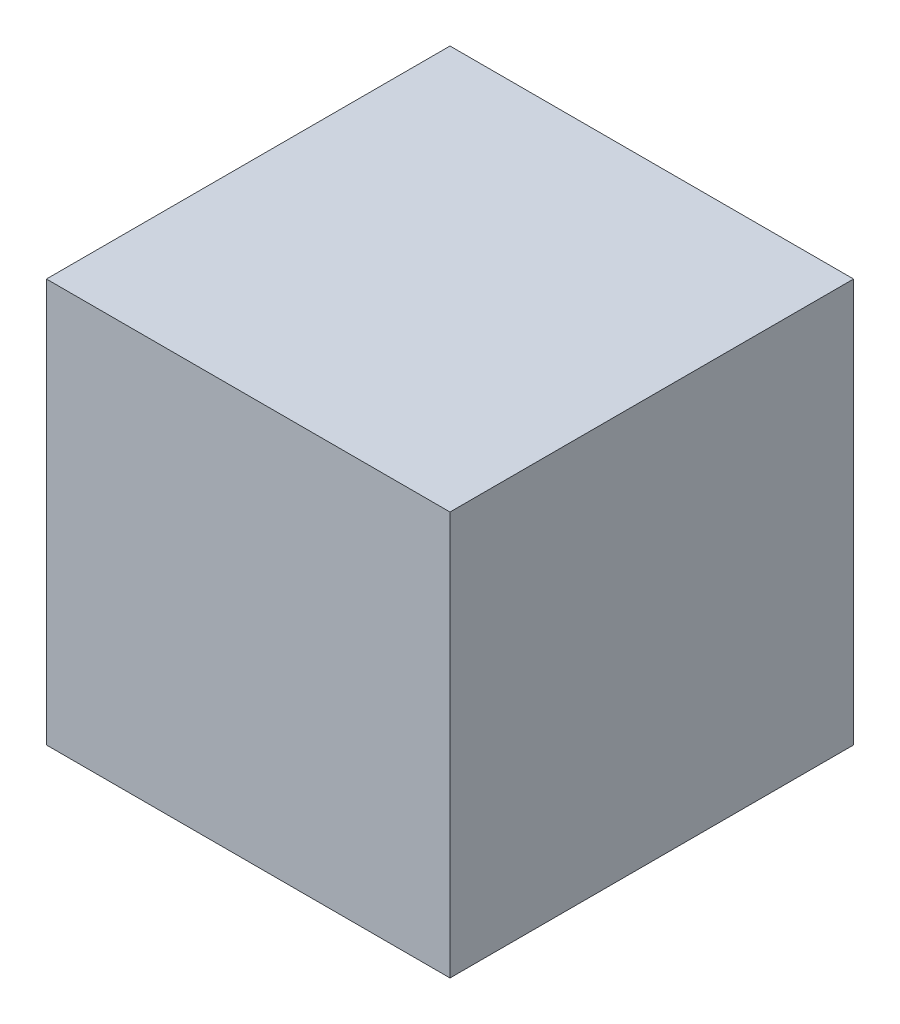
ISO-10303-21;
HEADER;
FILE_DESCRIPTION(('STEP AP214'),'2;1');
FILE_NAME('part.step','',(''),(''),'','','');
FILE_SCHEMA(('AUTOMOTIVE_DESIGN { 1 0 10303 214 1 1 1 1 }'));
ENDSEC;
DATA;
#1=APPLICATION_CONTEXT('core data for automotive mechanical design processes');
#2=APPLICATION_PROTOCOL_DEFINITION('international standard','automotive_design',2000,#1);
#3=PRODUCT_CONTEXT('',#1,'mechanical');
#4=PRODUCT('Part','Part','',(#3));
#5=PRODUCT_RELATED_PRODUCT_CATEGORY('part','',(#4));
#6=PRODUCT_DEFINITION_FORMATION('','',#4);
#7=PRODUCT_DEFINITION_CONTEXT('part definition',#1,'design');
#8=PRODUCT_DEFINITION('design','',#6,#7);
#9=PRODUCT_DEFINITION_SHAPE('','',#8);
#10=(LENGTH_UNIT() NAMED_UNIT(*) SI_UNIT(.MILLI.,.METRE.));
#11=(NAMED_UNIT(*) PLANE_ANGLE_UNIT() SI_UNIT($,.RADIAN.));
#12=(NAMED_UNIT(*) SI_UNIT($,.STERADIAN.) SOLID_ANGLE_UNIT());
#13=UNCERTAINTY_MEASURE_WITH_UNIT(LENGTH_MEASURE(1.E-05),#10,'distance_accuracy_value','');
#14=(GEOMETRIC_REPRESENTATION_CONTEXT(3) GLOBAL_UNCERTAINTY_ASSIGNED_CONTEXT((#13)) GLOBAL_UNIT_ASSIGNED_CONTEXT((#10,
#11,#12)) REPRESENTATION_CONTEXT('',''));
#15=CARTESIAN_POINT('',(0.,0.,0.));
#16=DIRECTION('',(0.,0.,1.));
#17=DIRECTION('',(1.,0.,0.));
#18=AXIS2_PLACEMENT_3D('',#15,#16,#17);
#19=CARTESIAN_POINT('',(50.,-50.,50.));
#20=DIRECTION('',(-1.,0.,0.));
#21=DIRECTION('',(0.,0.,1.));
#22=AXIS2_PLACEMENT_3D('',#19,#20,#21);
#23=PLANE('',#22);
#24=DIRECTION('',(0.,1.,0.));
#25=VECTOR('',#24,1.);
#26=CARTESIAN_POINT('',(50.,-50.,-50.));
#27=LINE('',#26,#25);
#28=CARTESIAN_POINT('',(50.,-50.,-50.));
#29=VERTEX_POINT('',#28);
#30=CARTESIAN_POINT('',(50.,50.,-50.));
#31=VERTEX_POINT('',#30);
#32=EDGE_CURVE('E98',#29,#31,#27,.T.);
#33=ORIENTED_EDGE('',*,*,#32,.T.);
#34=DIRECTION('',(0.,0.,-1.));
#35=VECTOR('',#34,1.);
#36=CARTESIAN_POINT('',(50.,50.,50.));
#37=LINE('',#36,#35);
#38=CARTESIAN_POINT('',(50.,50.,50.));
#39=VERTEX_POINT('',#38);
#40=EDGE_CURVE('E11',#39,#31,#37,.T.);
#41=ORIENTED_EDGE('',*,*,#40,.F.);
#42=DIRECTION('',(0.,1.,0.));
#43=VECTOR('',#42,1.);
#44=CARTESIAN_POINT('',(50.,-50.,50.));
#45=LINE('',#44,#43);
#46=CARTESIAN_POINT('',(50.,-50.,50.));
#47=VERTEX_POINT('',#46);
#48=EDGE_CURVE('E86',#47,#39,#45,.T.);
#49=ORIENTED_EDGE('',*,*,#48,.F.);
#50=DIRECTION('',(0.,0.,-1.));
#51=VECTOR('',#50,1.);
#52=CARTESIAN_POINT('',(50.,-50.,50.));
#53=LINE('',#52,#51);
#54=EDGE_CURVE('E94',#47,#29,#53,.T.);
#55=ORIENTED_EDGE('',*,*,#54,.T.);
#56=EDGE_LOOP('',(#33,#41,#49,#55));
#57=FACE_BOUND('',#56,.T.);
#58=ADVANCED_FACE('F35',(#57),#23,.F.);
#59=CARTESIAN_POINT('',(-50.,50.,50.));
#60=DIRECTION('',(0.,-1.,0.));
#61=DIRECTION('',(0.,0.,-1.));
#62=AXIS2_PLACEMENT_3D('',#59,#60,#61);
#63=PLANE('',#62);
#64=DIRECTION('',(-1.,0.,0.));
#65=VECTOR('',#64,1.);
#66=CARTESIAN_POINT('',(-50.,50.,-50.));
#67=LINE('',#66,#65);
#68=CARTESIAN_POINT('',(-50.,50.,-50.));
#69=VERTEX_POINT('',#68);
#70=EDGE_CURVE('E90',#31,#69,#67,.T.);
#71=ORIENTED_EDGE('',*,*,#70,.T.);
#72=DIRECTION('',(0.,0.,-1.));
#73=VECTOR('',#72,1.);
#74=CARTESIAN_POINT('',(-50.,50.,50.));
#75=LINE('',#74,#73);
#76=CARTESIAN_POINT('',(-50.,50.,50.));
#77=VERTEX_POINT('',#76);
#78=EDGE_CURVE('E43',#77,#69,#75,.T.);
#79=ORIENTED_EDGE('',*,*,#78,.F.);
#80=DIRECTION('',(-1.,0.,0.));
#81=VECTOR('',#80,1.);
#82=CARTESIAN_POINT('',(-50.,50.,50.));
#83=LINE('',#82,#81);
#84=EDGE_CURVE('E81',#39,#77,#83,.T.);
#85=ORIENTED_EDGE('',*,*,#84,.F.);
#86=ORIENTED_EDGE('',*,*,#40,.T.);
#87=EDGE_LOOP('',(#71,#79,#85,#86));
#88=FACE_BOUND('',#87,.T.);
#89=ADVANCED_FACE('F89',(#88),#63,.F.);
#90=CARTESIAN_POINT('',(-50.,-50.,50.));
#91=DIRECTION('',(1.,0.,0.));
#92=DIRECTION('',(0.,0.,-1.));
#93=AXIS2_PLACEMENT_3D('',#90,#91,#92);
#94=PLANE('',#93);
#95=DIRECTION('',(0.,-1.,0.));
#96=VECTOR('',#95,1.);
#97=CARTESIAN_POINT('',(-50.,-50.,-50.));
#98=LINE('',#97,#96);
#99=CARTESIAN_POINT('',(-50.,-50.,-50.));
#100=VERTEX_POINT('',#99);
#101=EDGE_CURVE('E68',#69,#100,#98,.T.);
#102=ORIENTED_EDGE('',*,*,#101,.T.);
#103=DIRECTION('',(0.,0.,-1.));
#104=VECTOR('',#103,1.);
#105=CARTESIAN_POINT('',(-50.,-50.,50.));
#106=LINE('',#105,#104);
#107=CARTESIAN_POINT('',(-50.,-50.,50.));
#108=VERTEX_POINT('',#107);
#109=EDGE_CURVE('E91',#108,#100,#106,.T.);
#110=ORIENTED_EDGE('',*,*,#109,.F.);
#111=DIRECTION('',(0.,-1.,0.));
#112=VECTOR('',#111,1.);
#113=CARTESIAN_POINT('',(-50.,-50.,50.));
#114=LINE('',#113,#112);
#115=EDGE_CURVE('E84',#77,#108,#114,.T.);
#116=ORIENTED_EDGE('',*,*,#115,.F.);
#117=ORIENTED_EDGE('',*,*,#78,.T.);
#118=EDGE_LOOP('',(#102,#110,#116,#117));
#119=FACE_BOUND('',#118,.T.);
#120=ADVANCED_FACE('F92',(#119),#94,.F.);
#121=CARTESIAN_POINT('',(-50.,-50.,50.));
#122=DIRECTION('',(0.,1.,0.));
#123=DIRECTION('',(0.,0.,1.));
#124=AXIS2_PLACEMENT_3D('',#121,#122,#123);
#125=PLANE('',#124);
#126=DIRECTION('',(1.,0.,0.));
#127=VECTOR('',#126,1.);
#128=CARTESIAN_POINT('',(-50.,-50.,-50.));
#129=LINE('',#128,#127);
#130=EDGE_CURVE('E74',#100,#29,#129,.T.);
#131=ORIENTED_EDGE('',*,*,#130,.T.);
#132=ORIENTED_EDGE('',*,*,#54,.F.);
#133=DIRECTION('',(1.,0.,0.));
#134=VECTOR('',#133,1.);
#135=CARTESIAN_POINT('',(-50.,-50.,50.));
#136=LINE('',#135,#134);
#137=EDGE_CURVE('E51',#108,#47,#136,.T.);
#138=ORIENTED_EDGE('',*,*,#137,.F.);
#139=ORIENTED_EDGE('',*,*,#109,.T.);
#140=EDGE_LOOP('',(#131,#132,#138,#139));
#141=FACE_BOUND('',#140,.T.);
#142=ADVANCED_FACE('F105',(#141),#125,.F.);
#143=CARTESIAN_POINT('',(0.,0.,50.));
#144=DIRECTION('',(0.,0.,-1.));
#145=DIRECTION('',(-1.,0.,0.));
#146=AXIS2_PLACEMENT_3D('',#143,#144,#145);
#147=PLANE('',#146);
#148=ORIENTED_EDGE('',*,*,#48,.T.);
#149=ORIENTED_EDGE('',*,*,#84,.T.);
#150=ORIENTED_EDGE('',*,*,#115,.T.);
#151=ORIENTED_EDGE('',*,*,#137,.T.);
#152=EDGE_LOOP('',(#148,#149,#150,#151));
#153=FACE_BOUND('',#152,.T.);
#154=ADVANCED_FACE('F82',(#153),#147,.F.);
#155=CARTESIAN_POINT('',(0.,0.,-50.));
#156=DIRECTION('',(0.,0.,-1.));
#157=DIRECTION('',(-1.,0.,0.));
#158=AXIS2_PLACEMENT_3D('',#155,#156,#157);
#159=PLANE('',#158);
#160=ORIENTED_EDGE('',*,*,#32,.F.);
#161=ORIENTED_EDGE('',*,*,#130,.F.);
#162=ORIENTED_EDGE('',*,*,#101,.F.);
#163=ORIENTED_EDGE('',*,*,#70,.F.);
#164=EDGE_LOOP('',(#160,#161,#162,#163));
#165=FACE_BOUND('',#164,.T.);
#166=ADVANCED_FACE('F108',(#165),#159,.T.);
#167=CLOSED_SHELL('',(#58,#89,#120,#142,#154,#166));
#168=MANIFOLD_SOLID_BREP('B2',#167);
#169=ADVANCED_BREP_SHAPE_REPRESENTATION('',(#18,#168),#14);
#170=SHAPE_DEFINITION_REPRESENTATION(#9,#169);
ENDSEC;
END-ISO-10303-21;
